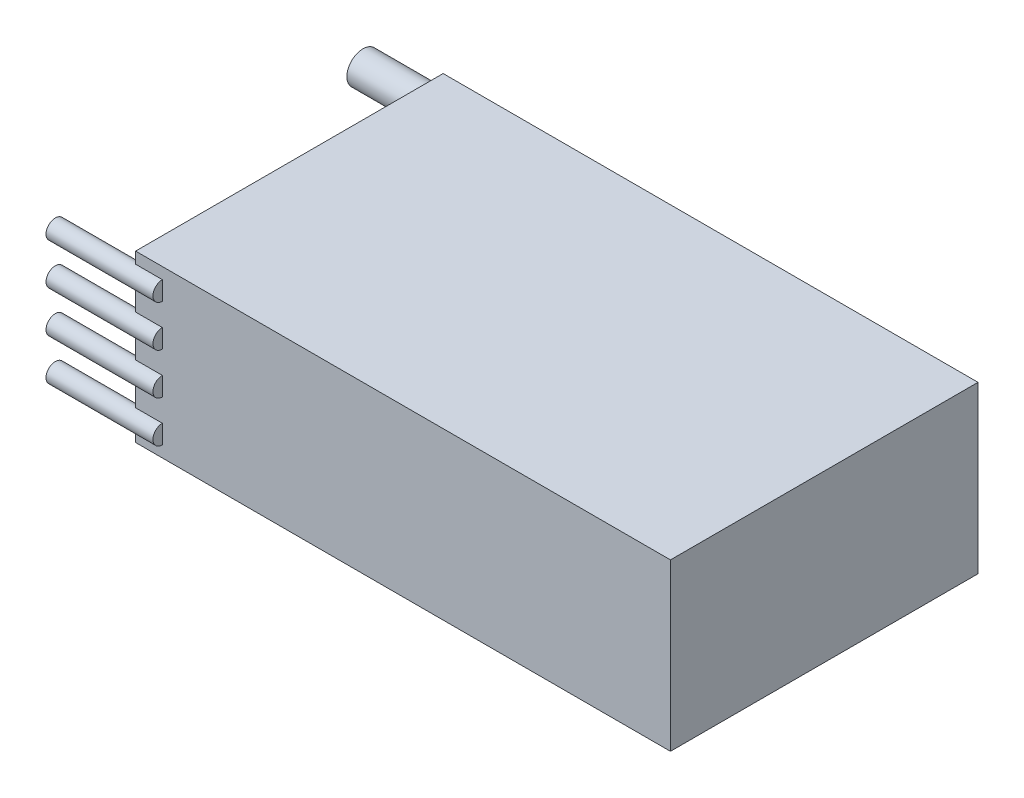
ISO-10303-21;
HEADER;
FILE_DESCRIPTION(('STEP AP214'),'2;1');
FILE_NAME('part.step','',(''),(''),'','','');
FILE_SCHEMA(('AUTOMOTIVE_DESIGN { 1 0 10303 214 1 1 1 1 }'));
ENDSEC;
DATA;
#1=APPLICATION_CONTEXT('core data for automotive mechanical design processes');
#2=APPLICATION_PROTOCOL_DEFINITION('international standard','automotive_design',2000,#1);
#3=PRODUCT_CONTEXT('',#1,'mechanical');
#4=PRODUCT('Part','Part','',(#3));
#5=PRODUCT_RELATED_PRODUCT_CATEGORY('part','',(#4));
#6=PRODUCT_DEFINITION_FORMATION('','',#4);
#7=PRODUCT_DEFINITION_CONTEXT('part definition',#1,'design');
#8=PRODUCT_DEFINITION('design','',#6,#7);
#9=PRODUCT_DEFINITION_SHAPE('','',#8);
#10=(LENGTH_UNIT() NAMED_UNIT(*) SI_UNIT(.MILLI.,.METRE.));
#11=(NAMED_UNIT(*) PLANE_ANGLE_UNIT() SI_UNIT($,.RADIAN.));
#12=(NAMED_UNIT(*) SI_UNIT($,.STERADIAN.) SOLID_ANGLE_UNIT());
#13=UNCERTAINTY_MEASURE_WITH_UNIT(LENGTH_MEASURE(1.E-05),#10,'distance_accuracy_value','');
#14=(GEOMETRIC_REPRESENTATION_CONTEXT(3) GLOBAL_UNCERTAINTY_ASSIGNED_CONTEXT((#13)) GLOBAL_UNIT_ASSIGNED_CONTEXT((#10,
#11,#12)) REPRESENTATION_CONTEXT('',''));
#15=CARTESIAN_POINT('',(0.,0.,0.));
#16=DIRECTION('',(0.,0.,1.));
#17=DIRECTION('',(1.,0.,0.));
#18=AXIS2_PLACEMENT_3D('',#15,#16,#17);
#19=CARTESIAN_POINT('',(-25.4,15.748,14.605));
#20=DIRECTION('',(1.,0.,0.));
#21=DIRECTION('',(0.,0.,-1.));
#22=AXIS2_PLACEMENT_3D('',#19,#20,#21);
#23=PLANE('',#22);
#24=DIRECTION('',(0.,-1.,0.));
#25=VECTOR('',#24,1.);
#26=CARTESIAN_POINT('',(-25.4,15.748,-14.605));
#27=LINE('',#26,#25);
#28=CARTESIAN_POINT('',(-25.4,10.922,-14.605));
#29=VERTEX_POINT('',#28);
#30=CARTESIAN_POINT('',(-25.4,4.826,-14.605));
#31=VERTEX_POINT('',#30);
#32=EDGE_CURVE('E212',#29,#31,#27,.T.);
#33=ORIENTED_EDGE('',*,*,#32,.T.);
#34=CARTESIAN_POINT('',(-25.4,3.302,-14.605));
#35=DIRECTION('',(1.,0.,0.));
#36=DIRECTION('',(0.,0.,-1.));
#37=AXIS2_PLACEMENT_3D('',#34,#35,#36);
#38=CIRCLE('',#37,1.524);
#39=CARTESIAN_POINT('',(-25.4,1.778,-14.605));
#40=VERTEX_POINT('',#39);
#41=EDGE_CURVE('E153',#31,#40,#38,.T.);
#42=ORIENTED_EDGE('',*,*,#41,.T.);
#43=CARTESIAN_POINT('',(-25.4,0.,-14.605));
#44=VERTEX_POINT('',#43);
#45=EDGE_CURVE('E159',#40,#44,#27,.T.);
#46=ORIENTED_EDGE('',*,*,#45,.T.);
#47=DIRECTION('',(0.,0.,1.));
#48=VECTOR('',#47,1.);
#49=CARTESIAN_POINT('',(-25.4,0.,14.605));
#50=LINE('',#49,#48);
#51=CARTESIAN_POINT('',(-25.4,0.,14.605));
#52=VERTEX_POINT('',#51);
#53=EDGE_CURVE('E220',#44,#52,#50,.T.);
#54=ORIENTED_EDGE('',*,*,#53,.T.);
#55=DIRECTION('',(0.,-1.,0.));
#56=VECTOR('',#55,1.);
#57=CARTESIAN_POINT('',(-25.4,15.748,14.605));
#58=LINE('',#57,#56);
#59=CARTESIAN_POINT('',(-25.4,1.0795,14.605));
#60=VERTEX_POINT('',#59);
#61=EDGE_CURVE('E201',#60,#52,#58,.T.);
#62=ORIENTED_EDGE('',*,*,#61,.F.);
#63=CARTESIAN_POINT('',(-25.4,1.9685,14.605));
#64=DIRECTION('',(1.,0.,0.));
#65=DIRECTION('',(0.,0.,-1.));
#66=AXIS2_PLACEMENT_3D('',#63,#64,#65);
#67=CIRCLE('',#66,0.889);
#68=CARTESIAN_POINT('',(-25.4,2.8575,14.605));
#69=VERTEX_POINT('',#68);
#70=EDGE_CURVE('E266',#60,#69,#67,.T.);
#71=ORIENTED_EDGE('',*,*,#70,.T.);
#72=CARTESIAN_POINT('',(-25.4,5.0165,14.605));
#73=VERTEX_POINT('',#72);
#74=EDGE_CURVE('E581',#73,#69,#58,.T.);
#75=ORIENTED_EDGE('',*,*,#74,.F.);
#76=CARTESIAN_POINT('',(-25.4,5.9055,14.605));
#77=DIRECTION('',(1.,0.,0.));
#78=DIRECTION('',(0.,0.,-1.));
#79=AXIS2_PLACEMENT_3D('',#76,#77,#78);
#80=CIRCLE('',#79,0.889);
#81=CARTESIAN_POINT('',(-25.4,6.7945,14.605));
#82=VERTEX_POINT('',#81);
#83=EDGE_CURVE('E257',#73,#82,#80,.T.);
#84=ORIENTED_EDGE('',*,*,#83,.T.);
#85=CARTESIAN_POINT('',(-25.4,8.9535,14.605));
#86=VERTEX_POINT('',#85);
#87=EDGE_CURVE('E202',#86,#82,#58,.T.);
#88=ORIENTED_EDGE('',*,*,#87,.F.);
#89=CARTESIAN_POINT('',(-25.4,9.8425,14.605));
#90=DIRECTION('',(1.,0.,0.));
#91=DIRECTION('',(0.,0.,-1.));
#92=AXIS2_PLACEMENT_3D('',#89,#90,#91);
#93=CIRCLE('',#92,0.889);
#94=CARTESIAN_POINT('',(-25.4,10.7315,14.605));
#95=VERTEX_POINT('',#94);
#96=EDGE_CURVE('E239',#86,#95,#93,.T.);
#97=ORIENTED_EDGE('',*,*,#96,.T.);
#98=CARTESIAN_POINT('',(-25.4,12.8905,14.605));
#99=VERTEX_POINT('',#98);
#100=EDGE_CURVE('E200',#99,#95,#58,.T.);
#101=ORIENTED_EDGE('',*,*,#100,.F.);
#102=CARTESIAN_POINT('',(-25.4,13.7795,14.605));
#103=DIRECTION('',(1.,0.,0.));
#104=DIRECTION('',(0.,0.,-1.));
#105=AXIS2_PLACEMENT_3D('',#102,#103,#104);
#106=CIRCLE('',#105,0.889);
#107=CARTESIAN_POINT('',(-25.4,14.6685,14.605));
#108=VERTEX_POINT('',#107);
#109=EDGE_CURVE('E248',#99,#108,#106,.T.);
#110=ORIENTED_EDGE('',*,*,#109,.T.);
#111=CARTESIAN_POINT('',(-25.4,15.748,14.605));
#112=VERTEX_POINT('',#111);
#113=EDGE_CURVE('E197',#112,#108,#58,.T.);
#114=ORIENTED_EDGE('',*,*,#113,.F.);
#115=DIRECTION('',(0.,0.,1.));
#116=VECTOR('',#115,1.);
#117=CARTESIAN_POINT('',(-25.4,15.748,14.605));
#118=LINE('',#117,#116);
#119=CARTESIAN_POINT('',(-25.4,15.748,-14.605));
#120=VERTEX_POINT('',#119);
#121=EDGE_CURVE('E215',#120,#112,#118,.T.);
#122=ORIENTED_EDGE('',*,*,#121,.F.);
#123=CARTESIAN_POINT('',(-25.4,13.97,-14.605));
#124=VERTEX_POINT('',#123);
#125=EDGE_CURVE('E209',#120,#124,#27,.T.);
#126=ORIENTED_EDGE('',*,*,#125,.T.);
#127=CARTESIAN_POINT('',(-25.4,12.446,-14.605));
#128=DIRECTION('',(1.,0.,0.));
#129=DIRECTION('',(0.,0.,-1.));
#130=AXIS2_PLACEMENT_3D('',#127,#128,#129);
#131=CIRCLE('',#130,1.524);
#132=EDGE_CURVE('E223',#124,#29,#131,.T.);
#133=ORIENTED_EDGE('',*,*,#132,.T.);
#134=EDGE_LOOP('',(#33,#42,#46,#54,#62,#71,#75,#84,#88,#97,#101,#110,#114,#122,#126,#133));
#135=FACE_BOUND('',#134,.T.);
#136=ADVANCED_FACE('F34',(#135),#23,.F.);
#137=CARTESIAN_POINT('',(25.4,15.748,14.605));
#138=DIRECTION('',(0.,0.,-1.));
#139=DIRECTION('',(-1.,0.,0.));
#140=AXIS2_PLACEMENT_3D('',#137,#138,#139);
#141=PLANE('',#140);
#142=DIRECTION('',(0.,1.,0.));
#143=VECTOR('',#142,1.);
#144=CARTESIAN_POINT('',(-22.86,15.748,14.605));
#145=LINE('',#144,#143);
#146=CARTESIAN_POINT('',(-22.86,1.0795,14.605));
#147=VERTEX_POINT('',#146);
#148=CARTESIAN_POINT('',(-22.86,2.8575,14.605));
#149=VERTEX_POINT('',#148);
#150=EDGE_CURVE('E55',#147,#149,#145,.T.);
#151=ORIENTED_EDGE('',*,*,#150,.F.);
#152=DIRECTION('',(-1.,0.,0.));
#153=VECTOR('',#152,1.);
#154=CARTESIAN_POINT('',(-22.86,1.0795,14.605));
#155=LINE('',#154,#153);
#156=EDGE_CURVE('E148',#147,#60,#155,.T.);
#157=ORIENTED_EDGE('',*,*,#156,.T.);
#158=ORIENTED_EDGE('',*,*,#61,.T.);
#159=DIRECTION('',(1.,0.,0.));
#160=VECTOR('',#159,1.);
#161=CARTESIAN_POINT('',(25.4,0.,14.605));
#162=LINE('',#161,#160);
#163=CARTESIAN_POINT('',(25.4,0.,14.605));
#164=VERTEX_POINT('',#163);
#165=EDGE_CURVE('E218',#52,#164,#162,.T.);
#166=ORIENTED_EDGE('',*,*,#165,.T.);
#167=DIRECTION('',(0.,-1.,0.));
#168=VECTOR('',#167,1.);
#169=CARTESIAN_POINT('',(25.4,15.748,14.605));
#170=LINE('',#169,#168);
#171=CARTESIAN_POINT('',(25.4,15.748,14.605));
#172=VERTEX_POINT('',#171);
#173=EDGE_CURVE('E203',#172,#164,#170,.T.);
#174=ORIENTED_EDGE('',*,*,#173,.F.);
#175=DIRECTION('',(1.,0.,0.));
#176=VECTOR('',#175,1.);
#177=CARTESIAN_POINT('',(25.4,15.748,14.605));
#178=LINE('',#177,#176);
#179=EDGE_CURVE('E228',#112,#172,#178,.T.);
#180=ORIENTED_EDGE('',*,*,#179,.F.);
#181=ORIENTED_EDGE('',*,*,#113,.T.);
#182=DIRECTION('',(-1.,0.,0.));
#183=VECTOR('',#182,1.);
#184=CARTESIAN_POINT('',(-22.86,14.6685,14.605));
#185=LINE('',#184,#183);
#186=CARTESIAN_POINT('',(-22.86,14.6685,14.605));
#187=VERTEX_POINT('',#186);
#188=EDGE_CURVE('E177',#108,#187,#185,.F.);
#189=ORIENTED_EDGE('',*,*,#188,.T.);
#190=DIRECTION('',(0.,-1.,0.));
#191=VECTOR('',#190,1.);
#192=CARTESIAN_POINT('',(-22.86,15.748,14.605));
#193=LINE('',#192,#191);
#194=CARTESIAN_POINT('',(-22.86,12.8905,14.605));
#195=VERTEX_POINT('',#194);
#196=EDGE_CURVE('E180',#187,#195,#193,.T.);
#197=ORIENTED_EDGE('',*,*,#196,.T.);
#198=DIRECTION('',(-1.,0.,0.));
#199=VECTOR('',#198,1.);
#200=CARTESIAN_POINT('',(-22.86,12.8905,14.605));
#201=LINE('',#200,#199);
#202=EDGE_CURVE('E174',#195,#99,#201,.T.);
#203=ORIENTED_EDGE('',*,*,#202,.T.);
#204=ORIENTED_EDGE('',*,*,#100,.T.);
#205=DIRECTION('',(-1.,0.,0.));
#206=VECTOR('',#205,1.);
#207=CARTESIAN_POINT('',(-22.86,10.7315,14.605));
#208=LINE('',#207,#206);
#209=CARTESIAN_POINT('',(-22.86,10.7315,14.605));
#210=VERTEX_POINT('',#209);
#211=EDGE_CURVE('E185',#95,#210,#208,.F.);
#212=ORIENTED_EDGE('',*,*,#211,.T.);
#213=DIRECTION('',(0.,1.,0.));
#214=VECTOR('',#213,1.);
#215=CARTESIAN_POINT('',(-22.86,15.748,14.605));
#216=LINE('',#215,#214);
#217=CARTESIAN_POINT('',(-22.86,8.9535,14.605));
#218=VERTEX_POINT('',#217);
#219=EDGE_CURVE('E187',#218,#210,#216,.T.);
#220=ORIENTED_EDGE('',*,*,#219,.F.);
#221=DIRECTION('',(-1.,0.,0.));
#222=VECTOR('',#221,1.);
#223=CARTESIAN_POINT('',(-22.86,8.9535,14.605));
#224=LINE('',#223,#222);
#225=EDGE_CURVE('E183',#218,#86,#224,.T.);
#226=ORIENTED_EDGE('',*,*,#225,.T.);
#227=ORIENTED_EDGE('',*,*,#87,.T.);
#228=DIRECTION('',(-1.,0.,0.));
#229=VECTOR('',#228,1.);
#230=CARTESIAN_POINT('',(-22.86,6.7945,14.605));
#231=LINE('',#230,#229);
#232=CARTESIAN_POINT('',(-22.86,6.7945,14.605));
#233=VERTEX_POINT('',#232);
#234=EDGE_CURVE('E168',#82,#233,#231,.F.);
#235=ORIENTED_EDGE('',*,*,#234,.T.);
#236=DIRECTION('',(0.,-1.,0.));
#237=VECTOR('',#236,1.);
#238=CARTESIAN_POINT('',(-22.86,15.748,14.605));
#239=LINE('',#238,#237);
#240=CARTESIAN_POINT('',(-22.86,5.0165,14.605));
#241=VERTEX_POINT('',#240);
#242=EDGE_CURVE('E171',#233,#241,#239,.T.);
#243=ORIENTED_EDGE('',*,*,#242,.T.);
#244=DIRECTION('',(-1.,0.,0.));
#245=VECTOR('',#244,1.);
#246=CARTESIAN_POINT('',(-22.86,5.0165,14.605));
#247=LINE('',#246,#245);
#248=EDGE_CURVE('E165',#241,#73,#247,.T.);
#249=ORIENTED_EDGE('',*,*,#248,.T.);
#250=ORIENTED_EDGE('',*,*,#74,.T.);
#251=DIRECTION('',(-1.,0.,0.));
#252=VECTOR('',#251,1.);
#253=CARTESIAN_POINT('',(-22.86,2.8575,14.605));
#254=LINE('',#253,#252);
#255=EDGE_CURVE('E162',#69,#149,#254,.F.);
#256=ORIENTED_EDGE('',*,*,#255,.T.);
#257=EDGE_LOOP('',(#151,#157,#158,#166,#174,#180,#181,#189,#197,#203,#204,#212,#220,#226,#227,
#235,#243,#249,#250,#256));
#258=FACE_BOUND('',#257,.T.);
#259=ADVANCED_FACE('F292',(#258),#141,.F.);
#260=CARTESIAN_POINT('',(25.4,15.748,14.605));
#261=DIRECTION('',(-1.,0.,0.));
#262=DIRECTION('',(0.,0.,1.));
#263=AXIS2_PLACEMENT_3D('',#260,#261,#262);
#264=PLANE('',#263);
#265=DIRECTION('',(0.,0.,-1.));
#266=VECTOR('',#265,1.);
#267=CARTESIAN_POINT('',(25.4,0.,14.605));
#268=LINE('',#267,#266);
#269=CARTESIAN_POINT('',(25.4,0.,-14.605));
#270=VERTEX_POINT('',#269);
#271=EDGE_CURVE('E216',#164,#270,#268,.T.);
#272=ORIENTED_EDGE('',*,*,#271,.T.);
#273=DIRECTION('',(0.,-1.,0.));
#274=VECTOR('',#273,1.);
#275=CARTESIAN_POINT('',(25.4,15.748,-14.605));
#276=LINE('',#275,#274);
#277=CARTESIAN_POINT('',(25.4,15.748,-14.605));
#278=VERTEX_POINT('',#277);
#279=EDGE_CURVE('E206',#278,#270,#276,.T.);
#280=ORIENTED_EDGE('',*,*,#279,.F.);
#281=DIRECTION('',(0.,0.,-1.));
#282=VECTOR('',#281,1.);
#283=CARTESIAN_POINT('',(25.4,15.748,14.605));
#284=LINE('',#283,#282);
#285=EDGE_CURVE('E226',#172,#278,#284,.T.);
#286=ORIENTED_EDGE('',*,*,#285,.F.);
#287=ORIENTED_EDGE('',*,*,#173,.T.);
#288=EDGE_LOOP('',(#272,#280,#286,#287));
#289=FACE_BOUND('',#288,.T.);
#290=ADVANCED_FACE('F297',(#289),#264,.F.);
#291=CARTESIAN_POINT('',(25.4,15.748,-14.605));
#292=DIRECTION('',(0.,0.,1.));
#293=DIRECTION('',(1.,0.,0.));
#294=AXIS2_PLACEMENT_3D('',#291,#292,#293);
#295=PLANE('',#294);
#296=DIRECTION('',(0.,1.,0.));
#297=VECTOR('',#296,1.);
#298=CARTESIAN_POINT('',(-22.86,15.748,-14.605));
#299=LINE('',#298,#297);
#300=CARTESIAN_POINT('',(-22.86,1.778,-14.605));
#301=VERTEX_POINT('',#300);
#302=CARTESIAN_POINT('',(-22.86,4.826,-14.605));
#303=VERTEX_POINT('',#302);
#304=EDGE_CURVE('E144',#301,#303,#299,.T.);
#305=ORIENTED_EDGE('',*,*,#304,.T.);
#306=DIRECTION('',(-1.,0.,0.));
#307=VECTOR('',#306,1.);
#308=CARTESIAN_POINT('',(-22.86,4.826,-14.605));
#309=LINE('',#308,#307);
#310=EDGE_CURVE('E11',#303,#31,#309,.T.);
#311=ORIENTED_EDGE('',*,*,#310,.T.);
#312=ORIENTED_EDGE('',*,*,#32,.F.);
#313=DIRECTION('',(-1.,0.,0.));
#314=VECTOR('',#313,1.);
#315=CARTESIAN_POINT('',(-22.86,10.922,-14.605));
#316=LINE('',#315,#314);
#317=CARTESIAN_POINT('',(-22.86,10.922,-14.605));
#318=VERTEX_POINT('',#317);
#319=EDGE_CURVE('E192',#29,#318,#316,.F.);
#320=ORIENTED_EDGE('',*,*,#319,.T.);
#321=DIRECTION('',(0.,-1.,0.));
#322=VECTOR('',#321,1.);
#323=CARTESIAN_POINT('',(-22.86,15.748,-14.605));
#324=LINE('',#323,#322);
#325=CARTESIAN_POINT('',(-22.86,13.97,-14.605));
#326=VERTEX_POINT('',#325);
#327=EDGE_CURVE('E194',#326,#318,#324,.T.);
#328=ORIENTED_EDGE('',*,*,#327,.F.);
#329=DIRECTION('',(-1.,0.,0.));
#330=VECTOR('',#329,1.);
#331=CARTESIAN_POINT('',(-22.86,13.97,-14.605));
#332=LINE('',#331,#330);
#333=EDGE_CURVE('E190',#326,#124,#332,.T.);
#334=ORIENTED_EDGE('',*,*,#333,.T.);
#335=ORIENTED_EDGE('',*,*,#125,.F.);
#336=DIRECTION('',(-1.,0.,0.));
#337=VECTOR('',#336,1.);
#338=CARTESIAN_POINT('',(25.4,15.748,-14.605));
#339=LINE('',#338,#337);
#340=EDGE_CURVE('E224',#278,#120,#339,.T.);
#341=ORIENTED_EDGE('',*,*,#340,.F.);
#342=ORIENTED_EDGE('',*,*,#279,.T.);
#343=DIRECTION('',(-1.,0.,0.));
#344=VECTOR('',#343,1.);
#345=CARTESIAN_POINT('',(25.4,0.,-14.605));
#346=LINE('',#345,#344);
#347=EDGE_CURVE('E213',#270,#44,#346,.T.);
#348=ORIENTED_EDGE('',*,*,#347,.T.);
#349=ORIENTED_EDGE('',*,*,#45,.F.);
#350=DIRECTION('',(-1.,0.,0.));
#351=VECTOR('',#350,1.);
#352=CARTESIAN_POINT('',(-22.86,1.778,-14.605));
#353=LINE('',#352,#351);
#354=EDGE_CURVE('E41',#40,#301,#353,.F.);
#355=ORIENTED_EDGE('',*,*,#354,.T.);
#356=EDGE_LOOP('',(#305,#311,#312,#320,#328,#334,#335,#341,#342,#348,#349,#355));
#357=FACE_BOUND('',#356,.T.);
#358=ADVANCED_FACE('F157',(#357),#295,.F.);
#359=CARTESIAN_POINT('',(0.,15.748,0.));
#360=DIRECTION('',(0.,1.,0.));
#361=DIRECTION('',(0.,0.,1.));
#362=AXIS2_PLACEMENT_3D('',#359,#360,#361);
#363=PLANE('',#362);
#364=ORIENTED_EDGE('',*,*,#121,.T.);
#365=ORIENTED_EDGE('',*,*,#179,.T.);
#366=ORIENTED_EDGE('',*,*,#285,.T.);
#367=ORIENTED_EDGE('',*,*,#340,.T.);
#368=EDGE_LOOP('',(#364,#365,#366,#367));
#369=FACE_BOUND('',#368,.T.);
#370=ADVANCED_FACE('F315',(#369),#363,.T.);
#371=CARTESIAN_POINT('',(0.,0.,0.));
#372=DIRECTION('',(0.,1.,0.));
#373=DIRECTION('',(0.,0.,1.));
#374=AXIS2_PLACEMENT_3D('',#371,#372,#373);
#375=PLANE('',#374);
#376=ORIENTED_EDGE('',*,*,#53,.F.);
#377=ORIENTED_EDGE('',*,*,#347,.F.);
#378=ORIENTED_EDGE('',*,*,#271,.F.);
#379=ORIENTED_EDGE('',*,*,#165,.F.);
#380=EDGE_LOOP('',(#376,#377,#378,#379));
#381=FACE_BOUND('',#380,.T.);
#382=ADVANCED_FACE('F310',(#381),#375,.F.);
#383=CARTESIAN_POINT('',(-22.86,12.446,-14.605));
#384=DIRECTION('',(-1.,0.,0.));
#385=DIRECTION('',(0.,0.,1.));
#386=AXIS2_PLACEMENT_3D('',#383,#384,#385);
#387=CYLINDRICAL_SURFACE('',#386,1.524);
#388=CARTESIAN_POINT('',(-33.02,12.446,-14.605));
#389=DIRECTION('',(-1.,0.,0.));
#390=DIRECTION('',(0.,0.,1.));
#391=AXIS2_PLACEMENT_3D('',#388,#389,#390);
#392=CIRCLE('',#391,1.524);
#393=CARTESIAN_POINT('',(-33.02,12.446,-13.081));
#394=VERTEX_POINT('',#393);
#395=EDGE_CURVE('E236',#394,#394,#392,.T.);
#396=ORIENTED_EDGE('',*,*,#395,.F.);
#397=EDGE_LOOP('',(#396));
#398=FACE_BOUND('',#397,.T.);
#399=ORIENTED_EDGE('',*,*,#333,.F.);
#400=CARTESIAN_POINT('',(-22.86,12.446,-14.605));
#401=DIRECTION('',(-1.,0.,0.));
#402=DIRECTION('',(0.,0.,1.));
#403=AXIS2_PLACEMENT_3D('',#400,#401,#402);
#404=CIRCLE('',#403,1.524);
#405=EDGE_CURVE('E233',#326,#318,#404,.T.);
#406=ORIENTED_EDGE('',*,*,#405,.T.);
#407=ORIENTED_EDGE('',*,*,#319,.F.);
#408=ORIENTED_EDGE('',*,*,#132,.F.);
#409=EDGE_LOOP('',(#399,#406,#407,#408));
#410=FACE_BOUND('',#409,.T.);
#411=ADVANCED_FACE('F358',(#398,#410),#387,.T.);
#412=CARTESIAN_POINT('',(-22.86,12.446,-14.605));
#413=DIRECTION('',(-1.,0.,0.));
#414=DIRECTION('',(0.,0.,1.));
#415=AXIS2_PLACEMENT_3D('',#412,#413,#414);
#416=PLANE('',#415);
#417=ORIENTED_EDGE('',*,*,#405,.F.);
#418=ORIENTED_EDGE('',*,*,#327,.T.);
#419=EDGE_LOOP('',(#417,#418));
#420=FACE_BOUND('',#419,.T.);
#421=ADVANCED_FACE('F354',(#420),#416,.F.);
#422=CARTESIAN_POINT('',(-33.02,12.446,-14.605));
#423=DIRECTION('',(-1.,0.,0.));
#424=DIRECTION('',(0.,0.,1.));
#425=AXIS2_PLACEMENT_3D('',#422,#423,#424);
#426=PLANE('',#425);
#427=ORIENTED_EDGE('',*,*,#395,.T.);
#428=EDGE_LOOP('',(#427));
#429=FACE_BOUND('',#428,.T.);
#430=ADVANCED_FACE('F350',(#429),#426,.T.);
#431=CARTESIAN_POINT('',(-22.86,9.8425,14.605));
#432=DIRECTION('',(-1.,0.,0.));
#433=DIRECTION('',(0.,0.,1.));
#434=AXIS2_PLACEMENT_3D('',#431,#432,#433);
#435=CYLINDRICAL_SURFACE('',#434,0.889);
#436=CARTESIAN_POINT('',(-33.02,9.8425,14.605));
#437=DIRECTION('',(-1.,0.,0.));
#438=DIRECTION('',(0.,0.,1.));
#439=AXIS2_PLACEMENT_3D('',#436,#437,#438);
#440=CIRCLE('',#439,0.889);
#441=CARTESIAN_POINT('',(-33.02,9.8425,15.494));
#442=VERTEX_POINT('',#441);
#443=EDGE_CURVE('E245',#442,#442,#440,.T.);
#444=ORIENTED_EDGE('',*,*,#443,.F.);
#445=EDGE_LOOP('',(#444));
#446=FACE_BOUND('',#445,.T.);
#447=ORIENTED_EDGE('',*,*,#225,.F.);
#448=CARTESIAN_POINT('',(-22.86,9.8425,14.605));
#449=DIRECTION('',(-1.,0.,0.));
#450=DIRECTION('',(0.,0.,1.));
#451=AXIS2_PLACEMENT_3D('',#448,#449,#450);
#452=CIRCLE('',#451,0.889);
#453=EDGE_CURVE('E242',#218,#210,#452,.T.);
#454=ORIENTED_EDGE('',*,*,#453,.T.);
#455=ORIENTED_EDGE('',*,*,#211,.F.);
#456=ORIENTED_EDGE('',*,*,#96,.F.);
#457=EDGE_LOOP('',(#447,#454,#455,#456));
#458=FACE_BOUND('',#457,.T.);
#459=ADVANCED_FACE('F346',(#446,#458),#435,.T.);
#460=CARTESIAN_POINT('',(-22.86,9.8425,14.605));
#461=DIRECTION('',(-1.,0.,0.));
#462=DIRECTION('',(0.,0.,1.));
#463=AXIS2_PLACEMENT_3D('',#460,#461,#462);
#464=PLANE('',#463);
#465=ORIENTED_EDGE('',*,*,#453,.F.);
#466=ORIENTED_EDGE('',*,*,#219,.T.);
#467=EDGE_LOOP('',(#465,#466));
#468=FACE_BOUND('',#467,.T.);
#469=ADVANCED_FACE('F342',(#468),#464,.F.);
#470=CARTESIAN_POINT('',(-33.02,9.8425,14.605));
#471=DIRECTION('',(-1.,0.,0.));
#472=DIRECTION('',(0.,0.,1.));
#473=AXIS2_PLACEMENT_3D('',#470,#471,#472);
#474=PLANE('',#473);
#475=ORIENTED_EDGE('',*,*,#443,.T.);
#476=EDGE_LOOP('',(#475));
#477=FACE_BOUND('',#476,.T.);
#478=ADVANCED_FACE('F335',(#477),#474,.T.);
#479=CARTESIAN_POINT('',(-22.86,13.7795,14.605));
#480=DIRECTION('',(-1.,0.,0.));
#481=DIRECTION('',(0.,0.,1.));
#482=AXIS2_PLACEMENT_3D('',#479,#480,#481);
#483=CYLINDRICAL_SURFACE('',#482,0.889);
#484=CARTESIAN_POINT('',(-33.02,13.7795,14.605));
#485=DIRECTION('',(-1.,0.,0.));
#486=DIRECTION('',(0.,0.,-1.));
#487=AXIS2_PLACEMENT_3D('',#484,#485,#486);
#488=CIRCLE('',#487,0.889);
#489=CARTESIAN_POINT('',(-33.02,13.7795,13.716));
#490=VERTEX_POINT('',#489);
#491=EDGE_CURVE('E254',#490,#490,#488,.T.);
#492=ORIENTED_EDGE('',*,*,#491,.F.);
#493=EDGE_LOOP('',(#492));
#494=FACE_BOUND('',#493,.T.);
#495=ORIENTED_EDGE('',*,*,#202,.F.);
#496=CARTESIAN_POINT('',(-22.86,13.7795,14.605));
#497=DIRECTION('',(-1.,0.,0.));
#498=DIRECTION('',(0.,0.,-1.));
#499=AXIS2_PLACEMENT_3D('',#496,#497,#498);
#500=CIRCLE('',#499,0.889);
#501=EDGE_CURVE('E251',#195,#187,#500,.T.);
#502=ORIENTED_EDGE('',*,*,#501,.T.);
#503=ORIENTED_EDGE('',*,*,#188,.F.);
#504=ORIENTED_EDGE('',*,*,#109,.F.);
#505=EDGE_LOOP('',(#495,#502,#503,#504));
#506=FACE_BOUND('',#505,.T.);
#507=ADVANCED_FACE('F322',(#494,#506),#483,.T.);
#508=CARTESIAN_POINT('',(-22.86,13.7795,14.605));
#509=DIRECTION('',(1.,0.,0.));
#510=DIRECTION('',(0.,0.,-1.));
#511=AXIS2_PLACEMENT_3D('',#508,#509,#510);
#512=PLANE('',#511);
#513=ORIENTED_EDGE('',*,*,#196,.F.);
#514=ORIENTED_EDGE('',*,*,#501,.F.);
#515=EDGE_LOOP('',(#513,#514));
#516=FACE_BOUND('',#515,.T.);
#517=ADVANCED_FACE('F324',(#516),#512,.T.);
#518=CARTESIAN_POINT('',(-33.02,13.7795,14.605));
#519=DIRECTION('',(1.,0.,0.));
#520=DIRECTION('',(0.,0.,-1.));
#521=AXIS2_PLACEMENT_3D('',#518,#519,#520);
#522=PLANE('',#521);
#523=ORIENTED_EDGE('',*,*,#491,.T.);
#524=EDGE_LOOP('',(#523));
#525=FACE_BOUND('',#524,.T.);
#526=ADVANCED_FACE('F326',(#525),#522,.F.);
#527=CARTESIAN_POINT('',(-22.86,5.9055,14.605));
#528=DIRECTION('',(-1.,0.,0.));
#529=DIRECTION('',(0.,0.,1.));
#530=AXIS2_PLACEMENT_3D('',#527,#528,#529);
#531=CYLINDRICAL_SURFACE('',#530,0.889);
#532=CARTESIAN_POINT('',(-33.02,5.9055,14.605));
#533=DIRECTION('',(-1.,0.,0.));
#534=DIRECTION('',(0.,0.,-1.));
#535=AXIS2_PLACEMENT_3D('',#532,#533,#534);
#536=CIRCLE('',#535,0.889);
#537=CARTESIAN_POINT('',(-33.02,5.9055,13.716));
#538=VERTEX_POINT('',#537);
#539=EDGE_CURVE('E263',#538,#538,#536,.T.);
#540=ORIENTED_EDGE('',*,*,#539,.F.);
#541=EDGE_LOOP('',(#540));
#542=FACE_BOUND('',#541,.T.);
#543=ORIENTED_EDGE('',*,*,#248,.F.);
#544=CARTESIAN_POINT('',(-22.86,5.9055,14.605));
#545=DIRECTION('',(-1.,0.,0.));
#546=DIRECTION('',(0.,0.,-1.));
#547=AXIS2_PLACEMENT_3D('',#544,#545,#546);
#548=CIRCLE('',#547,0.889);
#549=EDGE_CURVE('E260',#241,#233,#548,.T.);
#550=ORIENTED_EDGE('',*,*,#549,.T.);
#551=ORIENTED_EDGE('',*,*,#234,.F.);
#552=ORIENTED_EDGE('',*,*,#83,.F.);
#553=EDGE_LOOP('',(#543,#550,#551,#552));
#554=FACE_BOUND('',#553,.T.);
#555=ADVANCED_FACE('F332',(#542,#554),#531,.T.);
#556=CARTESIAN_POINT('',(-22.86,5.9055,14.605));
#557=DIRECTION('',(1.,0.,0.));
#558=DIRECTION('',(0.,0.,-1.));
#559=AXIS2_PLACEMENT_3D('',#556,#557,#558);
#560=PLANE('',#559);
#561=ORIENTED_EDGE('',*,*,#242,.F.);
#562=ORIENTED_EDGE('',*,*,#549,.F.);
#563=EDGE_LOOP('',(#561,#562));
#564=FACE_BOUND('',#563,.T.);
#565=ADVANCED_FACE('F446',(#564),#560,.T.);
#566=CARTESIAN_POINT('',(-33.02,5.9055,14.605));
#567=DIRECTION('',(1.,0.,0.));
#568=DIRECTION('',(0.,0.,-1.));
#569=AXIS2_PLACEMENT_3D('',#566,#567,#568);
#570=PLANE('',#569);
#571=ORIENTED_EDGE('',*,*,#539,.T.);
#572=EDGE_LOOP('',(#571));
#573=FACE_BOUND('',#572,.T.);
#574=ADVANCED_FACE('F455',(#573),#570,.F.);
#575=CARTESIAN_POINT('',(-22.86,1.9685,14.605));
#576=DIRECTION('',(-1.,0.,0.));
#577=DIRECTION('',(0.,0.,1.));
#578=AXIS2_PLACEMENT_3D('',#575,#576,#577);
#579=CYLINDRICAL_SURFACE('',#578,0.889);
#580=CARTESIAN_POINT('',(-33.02,1.9685,14.605));
#581=DIRECTION('',(-1.,0.,0.));
#582=DIRECTION('',(0.,0.,1.));
#583=AXIS2_PLACEMENT_3D('',#580,#581,#582);
#584=CIRCLE('',#583,0.889);
#585=CARTESIAN_POINT('',(-33.02,1.9685,15.494));
#586=VERTEX_POINT('',#585);
#587=EDGE_CURVE('E271',#586,#586,#584,.T.);
#588=ORIENTED_EDGE('',*,*,#587,.F.);
#589=EDGE_LOOP('',(#588));
#590=FACE_BOUND('',#589,.T.);
#591=ORIENTED_EDGE('',*,*,#156,.F.);
#592=CARTESIAN_POINT('',(-22.86,1.9685,14.605));
#593=DIRECTION('',(-1.,0.,0.));
#594=DIRECTION('',(0.,0.,1.));
#595=AXIS2_PLACEMENT_3D('',#592,#593,#594);
#596=CIRCLE('',#595,0.889);
#597=EDGE_CURVE('E268',#147,#149,#596,.T.);
#598=ORIENTED_EDGE('',*,*,#597,.T.);
#599=ORIENTED_EDGE('',*,*,#255,.F.);
#600=ORIENTED_EDGE('',*,*,#70,.F.);
#601=EDGE_LOOP('',(#591,#598,#599,#600));
#602=FACE_BOUND('',#601,.T.);
#603=ADVANCED_FACE('F465',(#590,#602),#579,.T.);
#604=CARTESIAN_POINT('',(-22.86,1.9685,14.605));
#605=DIRECTION('',(-1.,0.,0.));
#606=DIRECTION('',(0.,0.,1.));
#607=AXIS2_PLACEMENT_3D('',#604,#605,#606);
#608=PLANE('',#607);
#609=ORIENTED_EDGE('',*,*,#597,.F.);
#610=ORIENTED_EDGE('',*,*,#150,.T.);
#611=EDGE_LOOP('',(#609,#610));
#612=FACE_BOUND('',#611,.T.);
#613=ADVANCED_FACE('F288',(#612),#608,.F.);
#614=CARTESIAN_POINT('',(-33.02,1.9685,14.605));
#615=DIRECTION('',(-1.,0.,0.));
#616=DIRECTION('',(0.,0.,1.));
#617=AXIS2_PLACEMENT_3D('',#614,#615,#616);
#618=PLANE('',#617);
#619=ORIENTED_EDGE('',*,*,#587,.T.);
#620=EDGE_LOOP('',(#619));
#621=FACE_BOUND('',#620,.T.);
#622=ADVANCED_FACE('F281',(#621),#618,.T.);
#623=CARTESIAN_POINT('',(-22.86,3.302,-14.605));
#624=DIRECTION('',(-1.,0.,0.));
#625=DIRECTION('',(0.,0.,1.));
#626=AXIS2_PLACEMENT_3D('',#623,#624,#625);
#627=CYLINDRICAL_SURFACE('',#626,1.524);
#628=CARTESIAN_POINT('',(-33.02,3.302,-14.605));
#629=DIRECTION('',(-1.,0.,0.));
#630=DIRECTION('',(0.,0.,-1.));
#631=AXIS2_PLACEMENT_3D('',#628,#629,#630);
#632=CIRCLE('',#631,1.524);
#633=CARTESIAN_POINT('',(-33.02,3.302,-16.129));
#634=VERTEX_POINT('',#633);
#635=EDGE_CURVE('E154',#634,#634,#632,.T.);
#636=ORIENTED_EDGE('',*,*,#635,.F.);
#637=EDGE_LOOP('',(#636));
#638=FACE_BOUND('',#637,.T.);
#639=ORIENTED_EDGE('',*,*,#310,.F.);
#640=CARTESIAN_POINT('',(-22.86,3.302,-14.605));
#641=DIRECTION('',(-1.,0.,0.));
#642=DIRECTION('',(0.,0.,-1.));
#643=AXIS2_PLACEMENT_3D('',#640,#641,#642);
#644=CIRCLE('',#643,1.524);
#645=EDGE_CURVE('E47',#303,#301,#644,.T.);
#646=ORIENTED_EDGE('',*,*,#645,.T.);
#647=ORIENTED_EDGE('',*,*,#354,.F.);
#648=ORIENTED_EDGE('',*,*,#41,.F.);
#649=EDGE_LOOP('',(#639,#646,#647,#648));
#650=FACE_BOUND('',#649,.T.);
#651=ADVANCED_FACE('F151',(#638,#650),#627,.T.);
#652=CARTESIAN_POINT('',(-22.86,3.302,-14.605));
#653=DIRECTION('',(1.,0.,0.));
#654=DIRECTION('',(0.,0.,-1.));
#655=AXIS2_PLACEMENT_3D('',#652,#653,#654);
#656=PLANE('',#655);
#657=ORIENTED_EDGE('',*,*,#304,.F.);
#658=ORIENTED_EDGE('',*,*,#645,.F.);
#659=EDGE_LOOP('',(#657,#658));
#660=FACE_BOUND('',#659,.T.);
#661=ADVANCED_FACE('F145',(#660),#656,.T.);
#662=CARTESIAN_POINT('',(-33.02,3.302,-14.605));
#663=DIRECTION('',(1.,0.,0.));
#664=DIRECTION('',(0.,0.,-1.));
#665=AXIS2_PLACEMENT_3D('',#662,#663,#664);
#666=PLANE('',#665);
#667=ORIENTED_EDGE('',*,*,#635,.T.);
#668=EDGE_LOOP('',(#667));
#669=FACE_BOUND('',#668,.T.);
#670=ADVANCED_FACE('F278',(#669),#666,.F.);
#671=CLOSED_SHELL('',(#136,#259,#290,#358,#370,#382,#411,#421,#430,#459,#469,#478,#507,#517,
#526,#555,#565,#574,#603,#613,#622,#651,#661,#670));
#672=MANIFOLD_SOLID_BREP('B2',#671);
#673=ADVANCED_BREP_SHAPE_REPRESENTATION('',(#18,#672),#14);
#674=SHAPE_DEFINITION_REPRESENTATION(#9,#673);
ENDSEC;
END-ISO-10303-21;
